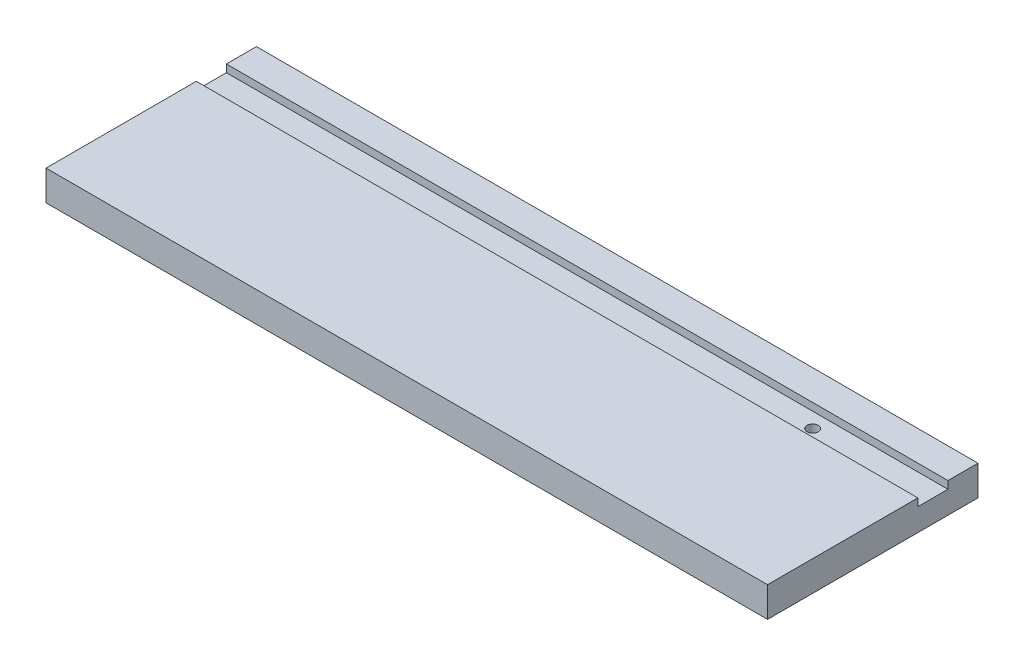
ISO-10303-21;
HEADER;
FILE_DESCRIPTION(('STEP AP214'),'2;1');
FILE_NAME('part.step','',(''),(''),'','','');
FILE_SCHEMA(('AUTOMOTIVE_DESIGN { 1 0 10303 214 1 1 1 1 }'));
ENDSEC;
DATA;
#1=APPLICATION_CONTEXT('core data for automotive mechanical design processes');
#2=APPLICATION_PROTOCOL_DEFINITION('international standard','automotive_design',2000,#1);
#3=PRODUCT_CONTEXT('',#1,'mechanical');
#4=PRODUCT('Part','Part','',(#3));
#5=PRODUCT_RELATED_PRODUCT_CATEGORY('part','',(#4));
#6=PRODUCT_DEFINITION_FORMATION('','',#4);
#7=PRODUCT_DEFINITION_CONTEXT('part definition',#1,'design');
#8=PRODUCT_DEFINITION('design','',#6,#7);
#9=PRODUCT_DEFINITION_SHAPE('','',#8);
#10=(LENGTH_UNIT() NAMED_UNIT(*) SI_UNIT(.MILLI.,.METRE.));
#11=(NAMED_UNIT(*) PLANE_ANGLE_UNIT() SI_UNIT($,.RADIAN.));
#12=(NAMED_UNIT(*) SI_UNIT($,.STERADIAN.) SOLID_ANGLE_UNIT());
#13=UNCERTAINTY_MEASURE_WITH_UNIT(LENGTH_MEASURE(1.E-05),#10,'distance_accuracy_value','');
#14=(GEOMETRIC_REPRESENTATION_CONTEXT(3) GLOBAL_UNCERTAINTY_ASSIGNED_CONTEXT((#13)) GLOBAL_UNIT_ASSIGNED_CONTEXT((#10,
#11,#12)) REPRESENTATION_CONTEXT('',''));
#15=CARTESIAN_POINT('',(0.,0.,0.));
#16=DIRECTION('',(0.,0.,1.));
#17=DIRECTION('',(1.,0.,0.));
#18=AXIS2_PLACEMENT_3D('',#15,#16,#17);
#19=CARTESIAN_POINT('',(0.,6.35,0.));
#20=DIRECTION('',(0.,-1.,0.));
#21=DIRECTION('',(0.,0.,-1.));
#22=AXIS2_PLACEMENT_3D('',#19,#20,#21);
#23=PLANE('',#22);
#24=DIRECTION('',(1.,0.,0.));
#25=VECTOR('',#24,1.);
#26=CARTESIAN_POINT('',(152.4,6.35,-31.75));
#27=LINE('',#26,#25);
#28=CARTESIAN_POINT('',(0.,6.35,-31.75));
#29=VERTEX_POINT('',#28);
#30=CARTESIAN_POINT('',(152.4,6.35,-31.75));
#31=VERTEX_POINT('',#30);
#32=EDGE_CURVE('E137',#29,#31,#27,.T.);
#33=ORIENTED_EDGE('',*,*,#32,.F.);
#34=DIRECTION('',(0.,0.,1.));
#35=VECTOR('',#34,1.);
#36=CARTESIAN_POINT('',(0.,6.35,0.));
#37=LINE('',#36,#35);
#38=CARTESIAN_POINT('',(0.,6.35,0.));
#39=VERTEX_POINT('',#38);
#40=EDGE_CURVE('E86',#29,#39,#37,.T.);
#41=ORIENTED_EDGE('',*,*,#40,.T.);
#42=DIRECTION('',(1.,0.,0.));
#43=VECTOR('',#42,1.);
#44=CARTESIAN_POINT('',(0.,6.35,0.));
#45=LINE('',#44,#43);
#46=CARTESIAN_POINT('',(152.4,6.35,0.));
#47=VERTEX_POINT('',#46);
#48=EDGE_CURVE('E149',#39,#47,#45,.T.);
#49=ORIENTED_EDGE('',*,*,#48,.T.);
#50=DIRECTION('',(0.,0.,-1.));
#51=VECTOR('',#50,1.);
#52=CARTESIAN_POINT('',(152.4,6.35,0.));
#53=LINE('',#52,#51);
#54=EDGE_CURVE('E152',#47,#31,#53,.T.);
#55=ORIENTED_EDGE('',*,*,#54,.T.);
#56=EDGE_LOOP('',(#33,#41,#49,#55));
#57=FACE_BOUND('',#56,.T.);
#58=ADVANCED_FACE('F33',(#57),#23,.F.);
#59=CARTESIAN_POINT('',(0.,6.35,0.));
#60=DIRECTION('',(1.,0.,0.));
#61=DIRECTION('',(0.,0.,-1.));
#62=AXIS2_PLACEMENT_3D('',#59,#60,#61);
#63=PLANE('',#62);
#64=ORIENTED_EDGE('',*,*,#40,.F.);
#65=DIRECTION('',(0.,1.,0.));
#66=VECTOR('',#65,1.);
#67=CARTESIAN_POINT('',(0.,4.7498,-31.75));
#68=LINE('',#67,#66);
#69=CARTESIAN_POINT('',(0.,4.7498,-31.75));
#70=VERTEX_POINT('',#69);
#71=EDGE_CURVE('E125',#70,#29,#68,.T.);
#72=ORIENTED_EDGE('',*,*,#71,.F.);
#73=DIRECTION('',(0.,0.,1.));
#74=VECTOR('',#73,1.);
#75=CARTESIAN_POINT('',(0.,4.7498,-38.1));
#76=LINE('',#75,#74);
#77=CARTESIAN_POINT('',(0.,4.7498,-38.1));
#78=VERTEX_POINT('',#77);
#79=EDGE_CURVE('E113',#78,#70,#76,.T.);
#80=ORIENTED_EDGE('',*,*,#79,.F.);
#81=DIRECTION('',(0.,1.,0.));
#82=VECTOR('',#81,1.);
#83=CARTESIAN_POINT('',(0.,4.7498,-38.1));
#84=LINE('',#83,#82);
#85=CARTESIAN_POINT('',(0.,6.35,-38.1));
#86=VERTEX_POINT('',#85);
#87=EDGE_CURVE('E120',#78,#86,#84,.T.);
#88=ORIENTED_EDGE('',*,*,#87,.T.);
#89=CARTESIAN_POINT('',(0.,6.35,-44.45));
#90=VERTEX_POINT('',#89);
#91=EDGE_CURVE('E147',#90,#86,#37,.T.);
#92=ORIENTED_EDGE('',*,*,#91,.F.);
#93=DIRECTION('',(0.,-1.,0.));
#94=VECTOR('',#93,1.);
#95=CARTESIAN_POINT('',(0.,6.35,-44.45));
#96=LINE('',#95,#94);
#97=CARTESIAN_POINT('',(0.,0.,-44.45));
#98=VERTEX_POINT('',#97);
#99=EDGE_CURVE('E156',#90,#98,#96,.T.);
#100=ORIENTED_EDGE('',*,*,#99,.T.);
#101=DIRECTION('',(0.,0.,1.));
#102=VECTOR('',#101,1.);
#103=CARTESIAN_POINT('',(0.,0.,0.));
#104=LINE('',#103,#102);
#105=CARTESIAN_POINT('',(0.,0.,0.));
#106=VERTEX_POINT('',#105);
#107=EDGE_CURVE('E145',#98,#106,#104,.T.);
#108=ORIENTED_EDGE('',*,*,#107,.T.);
#109=DIRECTION('',(0.,-1.,0.));
#110=VECTOR('',#109,1.);
#111=CARTESIAN_POINT('',(0.,6.35,0.));
#112=LINE('',#111,#110);
#113=EDGE_CURVE('E11',#39,#106,#112,.T.);
#114=ORIENTED_EDGE('',*,*,#113,.F.);
#115=EDGE_LOOP('',(#64,#72,#80,#88,#92,#100,#108,#114));
#116=FACE_BOUND('',#115,.T.);
#117=ADVANCED_FACE('F35',(#116),#63,.F.);
#118=CARTESIAN_POINT('',(0.,6.35,0.));
#119=DIRECTION('',(0.,0.,-1.));
#120=DIRECTION('',(-1.,0.,0.));
#121=AXIS2_PLACEMENT_3D('',#118,#119,#120);
#122=PLANE('',#121);
#123=DIRECTION('',(1.,0.,0.));
#124=VECTOR('',#123,1.);
#125=CARTESIAN_POINT('',(0.,0.,0.));
#126=LINE('',#125,#124);
#127=CARTESIAN_POINT('',(152.4,0.,0.));
#128=VERTEX_POINT('',#127);
#129=EDGE_CURVE('E159',#106,#128,#126,.T.);
#130=ORIENTED_EDGE('',*,*,#129,.T.);
#131=DIRECTION('',(0.,-1.,0.));
#132=VECTOR('',#131,1.);
#133=CARTESIAN_POINT('',(152.4,6.35,0.));
#134=LINE('',#133,#132);
#135=EDGE_CURVE('E41',#47,#128,#134,.T.);
#136=ORIENTED_EDGE('',*,*,#135,.F.);
#137=ORIENTED_EDGE('',*,*,#48,.F.);
#138=ORIENTED_EDGE('',*,*,#113,.T.);
#139=EDGE_LOOP('',(#130,#136,#137,#138));
#140=FACE_BOUND('',#139,.T.);
#141=ADVANCED_FACE('F196',(#140),#122,.F.);
#142=CARTESIAN_POINT('',(152.4,6.35,0.));
#143=DIRECTION('',(-1.,0.,0.));
#144=DIRECTION('',(0.,0.,1.));
#145=AXIS2_PLACEMENT_3D('',#142,#143,#144);
#146=PLANE('',#145);
#147=DIRECTION('',(0.,0.,-1.));
#148=VECTOR('',#147,1.);
#149=CARTESIAN_POINT('',(152.4,4.7498,-38.1));
#150=LINE('',#149,#148);
#151=CARTESIAN_POINT('',(152.4,4.7498,-31.75));
#152=VERTEX_POINT('',#151);
#153=CARTESIAN_POINT('',(152.4,4.7498,-38.1));
#154=VERTEX_POINT('',#153);
#155=EDGE_CURVE('E116',#152,#154,#150,.T.);
#156=ORIENTED_EDGE('',*,*,#155,.F.);
#157=DIRECTION('',(0.,1.,0.));
#158=VECTOR('',#157,1.);
#159=CARTESIAN_POINT('',(152.4,4.7498,-31.75));
#160=LINE('',#159,#158);
#161=EDGE_CURVE('E142',#152,#31,#160,.T.);
#162=ORIENTED_EDGE('',*,*,#161,.T.);
#163=ORIENTED_EDGE('',*,*,#54,.F.);
#164=ORIENTED_EDGE('',*,*,#135,.T.);
#165=DIRECTION('',(0.,0.,-1.));
#166=VECTOR('',#165,1.);
#167=CARTESIAN_POINT('',(152.4,0.,0.));
#168=LINE('',#167,#166);
#169=CARTESIAN_POINT('',(152.4,0.,-44.45));
#170=VERTEX_POINT('',#169);
#171=EDGE_CURVE('E161',#128,#170,#168,.T.);
#172=ORIENTED_EDGE('',*,*,#171,.T.);
#173=DIRECTION('',(0.,-1.,0.));
#174=VECTOR('',#173,1.);
#175=CARTESIAN_POINT('',(152.4,6.35,-44.45));
#176=LINE('',#175,#174);
#177=CARTESIAN_POINT('',(152.4,6.35,-44.45));
#178=VERTEX_POINT('',#177);
#179=EDGE_CURVE('E165',#178,#170,#176,.T.);
#180=ORIENTED_EDGE('',*,*,#179,.F.);
#181=CARTESIAN_POINT('',(152.4,6.35,-38.1));
#182=VERTEX_POINT('',#181);
#183=EDGE_CURVE('E151',#182,#178,#53,.T.);
#184=ORIENTED_EDGE('',*,*,#183,.F.);
#185=DIRECTION('',(0.,1.,0.));
#186=VECTOR('',#185,1.);
#187=CARTESIAN_POINT('',(152.4,4.7498,-38.1));
#188=LINE('',#187,#186);
#189=EDGE_CURVE('E48',#154,#182,#188,.T.);
#190=ORIENTED_EDGE('',*,*,#189,.F.);
#191=EDGE_LOOP('',(#156,#162,#163,#164,#172,#180,#184,#190));
#192=FACE_BOUND('',#191,.T.);
#193=ADVANCED_FACE('F171',(#192),#146,.F.);
#194=CARTESIAN_POINT('',(0.,6.35,-44.45));
#195=DIRECTION('',(0.,0.,1.));
#196=DIRECTION('',(1.,0.,0.));
#197=AXIS2_PLACEMENT_3D('',#194,#195,#196);
#198=PLANE('',#197);
#199=DIRECTION('',(-1.,0.,0.));
#200=VECTOR('',#199,1.);
#201=CARTESIAN_POINT('',(0.,0.,-44.45));
#202=LINE('',#201,#200);
#203=EDGE_CURVE('E78',#170,#98,#202,.T.);
#204=ORIENTED_EDGE('',*,*,#203,.T.);
#205=ORIENTED_EDGE('',*,*,#99,.F.);
#206=DIRECTION('',(-1.,0.,0.));
#207=VECTOR('',#206,1.);
#208=CARTESIAN_POINT('',(0.,6.35,-44.45));
#209=LINE('',#208,#207);
#210=EDGE_CURVE('E57',#178,#90,#209,.T.);
#211=ORIENTED_EDGE('',*,*,#210,.F.);
#212=ORIENTED_EDGE('',*,*,#179,.T.);
#213=EDGE_LOOP('',(#204,#205,#211,#212));
#214=FACE_BOUND('',#213,.T.);
#215=ADVANCED_FACE('F178',(#214),#198,.F.);
#216=ORIENTED_EDGE('',*,*,#91,.T.);
#217=DIRECTION('',(-1.,0.,0.));
#218=VECTOR('',#217,1.);
#219=CARTESIAN_POINT('',(152.4,6.35,-38.1));
#220=LINE('',#219,#218);
#221=EDGE_CURVE('E122',#182,#86,#220,.T.);
#222=ORIENTED_EDGE('',*,*,#221,.F.);
#223=ORIENTED_EDGE('',*,*,#183,.T.);
#224=ORIENTED_EDGE('',*,*,#210,.T.);
#225=EDGE_LOOP('',(#216,#222,#223,#224));
#226=FACE_BOUND('',#225,.T.);
#227=ADVANCED_FACE('F180',(#226),#23,.F.);
#228=CARTESIAN_POINT('',(0.,0.,0.));
#229=DIRECTION('',(0.,-1.,0.));
#230=DIRECTION('',(0.,0.,-1.));
#231=AXIS2_PLACEMENT_3D('',#228,#229,#230);
#232=PLANE('',#231);
#233=CARTESIAN_POINT('',(127.,0.,-34.925));
#234=DIRECTION('',(0.,1.,0.));
#235=DIRECTION('',(0.,0.,1.));
#236=AXIS2_PLACEMENT_3D('',#233,#234,#235);
#237=CIRCLE('',#236,1.18745000000001);
#238=CARTESIAN_POINT('',(127.,0.,-33.73755));
#239=VERTEX_POINT('',#238);
#240=EDGE_CURVE('E132',#239,#239,#237,.T.);
#241=ORIENTED_EDGE('',*,*,#240,.T.);
#242=EDGE_LOOP('',(#241));
#243=FACE_BOUND('',#242,.T.);
#244=ORIENTED_EDGE('',*,*,#107,.F.);
#245=ORIENTED_EDGE('',*,*,#203,.F.);
#246=ORIENTED_EDGE('',*,*,#171,.F.);
#247=ORIENTED_EDGE('',*,*,#129,.F.);
#248=EDGE_LOOP('',(#244,#245,#246,#247));
#249=FACE_BOUND('',#248,.T.);
#250=ADVANCED_FACE('F176',(#243,#249),#232,.T.);
#251=CARTESIAN_POINT('',(152.4,4.7498,-31.75));
#252=DIRECTION('',(0.,0.,1.));
#253=DIRECTION('',(1.,0.,0.));
#254=AXIS2_PLACEMENT_3D('',#251,#252,#253);
#255=PLANE('',#254);
#256=ORIENTED_EDGE('',*,*,#32,.T.);
#257=ORIENTED_EDGE('',*,*,#161,.F.);
#258=DIRECTION('',(1.,0.,0.));
#259=VECTOR('',#258,1.);
#260=CARTESIAN_POINT('',(152.4,4.7498,-31.75));
#261=LINE('',#260,#259);
#262=EDGE_CURVE('E117',#70,#152,#261,.T.);
#263=ORIENTED_EDGE('',*,*,#262,.F.);
#264=ORIENTED_EDGE('',*,*,#71,.T.);
#265=EDGE_LOOP('',(#256,#257,#263,#264));
#266=FACE_BOUND('',#265,.T.);
#267=ADVANCED_FACE('F187',(#266),#255,.F.);
#268=CARTESIAN_POINT('',(152.4,4.7498,-38.1));
#269=DIRECTION('',(0.,0.,-1.));
#270=DIRECTION('',(-1.,0.,0.));
#271=AXIS2_PLACEMENT_3D('',#268,#269,#270);
#272=PLANE('',#271);
#273=ORIENTED_EDGE('',*,*,#221,.T.);
#274=ORIENTED_EDGE('',*,*,#87,.F.);
#275=DIRECTION('',(-1.,0.,0.));
#276=VECTOR('',#275,1.);
#277=CARTESIAN_POINT('',(152.4,4.7498,-38.1));
#278=LINE('',#277,#276);
#279=EDGE_CURVE('E108',#154,#78,#278,.T.);
#280=ORIENTED_EDGE('',*,*,#279,.F.);
#281=ORIENTED_EDGE('',*,*,#189,.T.);
#282=EDGE_LOOP('',(#273,#274,#280,#281));
#283=FACE_BOUND('',#282,.T.);
#284=ADVANCED_FACE('F121',(#283),#272,.F.);
#285=CARTESIAN_POINT('',(0.,4.7498,0.));
#286=DIRECTION('',(0.,-1.,0.));
#287=DIRECTION('',(0.,0.,-1.));
#288=AXIS2_PLACEMENT_3D('',#285,#286,#287);
#289=PLANE('',#288);
#290=CARTESIAN_POINT('',(127.,4.7498,-34.925));
#291=DIRECTION('',(0.,1.,0.));
#292=DIRECTION('',(0.,0.,1.));
#293=AXIS2_PLACEMENT_3D('',#290,#291,#292);
#294=CIRCLE('',#293,1.18745000000001);
#295=CARTESIAN_POINT('',(127.,4.7498,-33.73755));
#296=VERTEX_POINT('',#295);
#297=EDGE_CURVE('E130',#296,#296,#294,.T.);
#298=ORIENTED_EDGE('',*,*,#297,.F.);
#299=EDGE_LOOP('',(#298));
#300=FACE_BOUND('',#299,.T.);
#301=ORIENTED_EDGE('',*,*,#155,.T.);
#302=ORIENTED_EDGE('',*,*,#279,.T.);
#303=ORIENTED_EDGE('',*,*,#79,.T.);
#304=ORIENTED_EDGE('',*,*,#262,.T.);
#305=EDGE_LOOP('',(#301,#302,#303,#304));
#306=FACE_BOUND('',#305,.T.);
#307=ADVANCED_FACE('F110',(#300,#306),#289,.F.);
#308=CARTESIAN_POINT('',(127.,0.,-34.925));
#309=DIRECTION('',(0.,1.,0.));
#310=DIRECTION('',(0.,0.,1.));
#311=AXIS2_PLACEMENT_3D('',#308,#309,#310);
#312=CYLINDRICAL_SURFACE('',#311,1.18745000000001);
#313=ORIENTED_EDGE('',*,*,#240,.F.);
#314=EDGE_LOOP('',(#313));
#315=FACE_BOUND('',#314,.T.);
#316=ORIENTED_EDGE('',*,*,#297,.T.);
#317=EDGE_LOOP('',(#316));
#318=FACE_BOUND('',#317,.T.);
#319=ADVANCED_FACE('F206',(#315,#318),#312,.F.);
#320=CLOSED_SHELL('',(#58,#117,#141,#193,#215,#227,#250,#267,#284,#307,#319));
#321=MANIFOLD_SOLID_BREP('B2',#320);
#322=ADVANCED_BREP_SHAPE_REPRESENTATION('',(#18,#321),#14);
#323=SHAPE_DEFINITION_REPRESENTATION(#9,#322);
ENDSEC;
END-ISO-10303-21;
